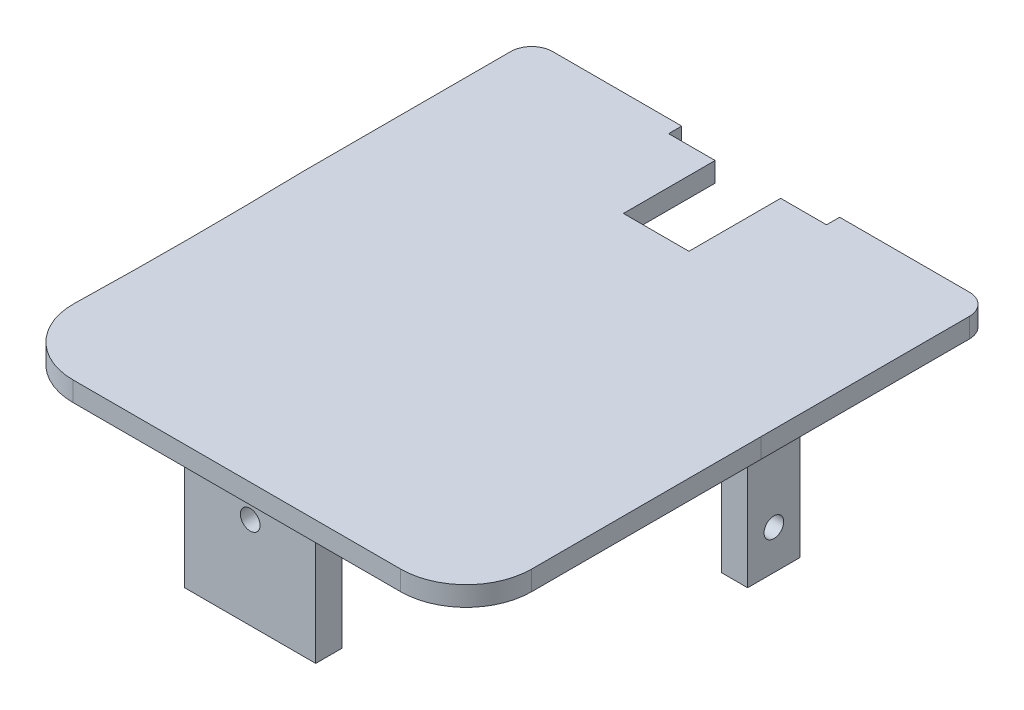
ISO-10303-21;
HEADER;
FILE_DESCRIPTION(('STEP AP214'),'2;1');
FILE_NAME('part.step','',(''),(''),'','','');
FILE_SCHEMA(('AUTOMOTIVE_DESIGN { 1 0 10303 214 1 1 1 1 }'));
ENDSEC;
DATA;
#1=APPLICATION_CONTEXT('core data for automotive mechanical design processes');
#2=APPLICATION_PROTOCOL_DEFINITION('international standard','automotive_design',2000,#1);
#3=PRODUCT_CONTEXT('',#1,'mechanical');
#4=PRODUCT('Part','Part','',(#3));
#5=PRODUCT_RELATED_PRODUCT_CATEGORY('part','',(#4));
#6=PRODUCT_DEFINITION_FORMATION('','',#4);
#7=PRODUCT_DEFINITION_CONTEXT('part definition',#1,'design');
#8=PRODUCT_DEFINITION('design','',#6,#7);
#9=PRODUCT_DEFINITION_SHAPE('','',#8);
#10=(LENGTH_UNIT() NAMED_UNIT(*) SI_UNIT(.MILLI.,.METRE.));
#11=(NAMED_UNIT(*) PLANE_ANGLE_UNIT() SI_UNIT($,.RADIAN.));
#12=(NAMED_UNIT(*) SI_UNIT($,.STERADIAN.) SOLID_ANGLE_UNIT());
#13=UNCERTAINTY_MEASURE_WITH_UNIT(LENGTH_MEASURE(1.E-05),#10,'distance_accuracy_value','');
#14=(GEOMETRIC_REPRESENTATION_CONTEXT(3) GLOBAL_UNCERTAINTY_ASSIGNED_CONTEXT((#13)) GLOBAL_UNIT_ASSIGNED_CONTEXT((#10,
#11,#12)) REPRESENTATION_CONTEXT('',''));
#15=CARTESIAN_POINT('',(0.,0.,0.));
#16=DIRECTION('',(0.,0.,1.));
#17=DIRECTION('',(1.,0.,0.));
#18=AXIS2_PLACEMENT_3D('',#15,#16,#17);
#19=CARTESIAN_POINT('',(0.,-19.,0.));
#20=DIRECTION('',(0.,1.,0.));
#21=DIRECTION('',(0.,0.,1.));
#22=AXIS2_PLACEMENT_3D('',#19,#20,#21);
#23=PLANE('',#22);
#24=DIRECTION('',(-1.,0.,0.));
#25=VECTOR('',#24,1.);
#26=CARTESIAN_POINT('',(-7.23999999999991,-19.,-1.24999999999999));
#27=LINE('',#26,#25);
#28=CARTESIAN_POINT('',(-7.23999999999991,-19.,-1.24999999999999));
#29=VERTEX_POINT('',#28);
#30=CARTESIAN_POINT('',(-8.23999999999991,-19.,-1.24999999999999));
#31=VERTEX_POINT('',#30);
#32=EDGE_CURVE('E431',#29,#31,#27,.T.);
#33=ORIENTED_EDGE('',*,*,#32,.F.);
#34=DIRECTION('',(0.,0.,-1.));
#35=VECTOR('',#34,1.);
#36=CARTESIAN_POINT('',(-7.23999999999991,-19.,-1.24999999999999));
#37=LINE('',#36,#35);
#38=CARTESIAN_POINT('',(-7.23999999999991,-19.,-3.24999999999999));
#39=VERTEX_POINT('',#38);
#40=EDGE_CURVE('E418',#29,#39,#37,.T.);
#41=ORIENTED_EDGE('',*,*,#40,.T.);
#42=DIRECTION('',(-1.,0.,0.));
#43=VECTOR('',#42,1.);
#44=CARTESIAN_POINT('',(-7.23999999999991,-19.,-3.24999999999999));
#45=LINE('',#44,#43);
#46=CARTESIAN_POINT('',(-8.23999999999991,-19.,-3.24999999999999));
#47=VERTEX_POINT('',#46);
#48=EDGE_CURVE('E422',#39,#47,#45,.T.);
#49=ORIENTED_EDGE('',*,*,#48,.T.);
#50=DIRECTION('',(0.,0.,-1.));
#51=VECTOR('',#50,1.);
#52=CARTESIAN_POINT('',(-8.23999999999991,-19.,-1.24999999999999));
#53=LINE('',#52,#51);
#54=EDGE_CURVE('E427',#31,#47,#53,.T.);
#55=ORIENTED_EDGE('',*,*,#54,.F.);
#56=EDGE_LOOP('',(#33,#41,#49,#55));
#57=FACE_BOUND('',#56,.T.);
#58=DIRECTION('',(0.,0.,-1.));
#59=VECTOR('',#58,1.);
#60=CARTESIAN_POINT('',(-2.49999999999991,-19.,0.));
#61=LINE('',#60,#59);
#62=CARTESIAN_POINT('',(-2.49999999999991,-19.,9.49));
#63=VERTEX_POINT('',#62);
#64=CARTESIAN_POINT('',(-2.49999999999991,-19.,8.49000000000001));
#65=VERTEX_POINT('',#64);
#66=EDGE_CURVE('E566',#63,#65,#61,.T.);
#67=ORIENTED_EDGE('',*,*,#66,.F.);
#68=DIRECTION('',(1.,0.,0.));
#69=VECTOR('',#68,1.);
#70=CARTESIAN_POINT('',(0.,-19.,9.49));
#71=LINE('',#70,#69);
#72=CARTESIAN_POINT('',(2.50000000000009,-19.,9.49000000000001));
#73=VERTEX_POINT('',#72);
#74=EDGE_CURVE('E533',#63,#73,#71,.T.);
#75=ORIENTED_EDGE('',*,*,#74,.T.);
#76=DIRECTION('',(0.,0.,-1.));
#77=VECTOR('',#76,1.);
#78=CARTESIAN_POINT('',(2.50000000000009,-19.,0.));
#79=LINE('',#78,#77);
#80=CARTESIAN_POINT('',(2.50000000000009,-19.,8.49000000000001));
#81=VERTEX_POINT('',#80);
#82=EDGE_CURVE('E580',#73,#81,#79,.T.);
#83=ORIENTED_EDGE('',*,*,#82,.T.);
#84=DIRECTION('',(1.,0.,0.));
#85=VECTOR('',#84,1.);
#86=CARTESIAN_POINT('',(0.,-19.,8.49000000000001));
#87=LINE('',#86,#85);
#88=EDGE_CURVE('E584',#65,#81,#87,.T.);
#89=ORIENTED_EDGE('',*,*,#88,.F.);
#90=EDGE_LOOP('',(#67,#75,#83,#89));
#91=FACE_BOUND('',#90,.T.);
#92=DIRECTION('',(0.,0.,-1.));
#93=VECTOR('',#92,1.);
#94=CARTESIAN_POINT('',(7.23999999999991,-19.,-1.24999999999999));
#95=LINE('',#94,#93);
#96=CARTESIAN_POINT('',(7.23999999999991,-19.,-1.24999999999999));
#97=VERTEX_POINT('',#96);
#98=CARTESIAN_POINT('',(7.23999999999991,-19.,-3.24999999999999));
#99=VERTEX_POINT('',#98);
#100=EDGE_CURVE('E374',#97,#99,#95,.T.);
#101=ORIENTED_EDGE('',*,*,#100,.F.);
#102=DIRECTION('',(1.,0.,0.));
#103=VECTOR('',#102,1.);
#104=CARTESIAN_POINT('',(7.23999999999991,-19.,-1.24999999999999));
#105=LINE('',#104,#103);
#106=CARTESIAN_POINT('',(8.23999999999991,-19.,-1.24999999999999));
#107=VERTEX_POINT('',#106);
#108=EDGE_CURVE('E354',#97,#107,#105,.T.);
#109=ORIENTED_EDGE('',*,*,#108,.T.);
#110=DIRECTION('',(0.,0.,-1.));
#111=VECTOR('',#110,1.);
#112=CARTESIAN_POINT('',(8.23999999999991,-19.,-1.24999999999999));
#113=LINE('',#112,#111);
#114=CARTESIAN_POINT('',(8.23999999999991,-19.,-3.24999999999999));
#115=VERTEX_POINT('',#114);
#116=EDGE_CURVE('E360',#107,#115,#113,.T.);
#117=ORIENTED_EDGE('',*,*,#116,.T.);
#118=DIRECTION('',(1.,0.,0.));
#119=VECTOR('',#118,1.);
#120=CARTESIAN_POINT('',(7.23999999999991,-19.,-3.24999999999999));
#121=LINE('',#120,#119);
#122=EDGE_CURVE('E377',#99,#115,#121,.T.);
#123=ORIENTED_EDGE('',*,*,#122,.F.);
#124=EDGE_LOOP('',(#101,#109,#117,#123));
#125=FACE_BOUND('',#124,.T.);
#126=DIRECTION('',(1.,0.,0.));
#127=VECTOR('',#126,1.);
#128=CARTESIAN_POINT('',(0.,-19.,-9.5));
#129=LINE('',#128,#127);
#130=CARTESIAN_POINT('',(1.25,-19.,-9.5));
#131=VERTEX_POINT('',#130);
#132=CARTESIAN_POINT('',(3.0000000000001,-19.,-9.5));
#133=VERTEX_POINT('',#132);
#134=EDGE_CURVE('E302',#131,#133,#129,.T.);
#135=ORIENTED_EDGE('',*,*,#134,.T.);
#136=DIRECTION('',(0.,0.,-1.));
#137=VECTOR('',#136,1.);
#138=CARTESIAN_POINT('',(3.0000000000001,-19.,0.));
#139=LINE('',#138,#137);
#140=CARTESIAN_POINT('',(3.0000000000001,-19.,-10.));
#141=VERTEX_POINT('',#140);
#142=EDGE_CURVE('E310',#133,#141,#139,.T.);
#143=ORIENTED_EDGE('',*,*,#142,.T.);
#144=DIRECTION('',(1.,0.,0.));
#145=VECTOR('',#144,1.);
#146=CARTESIAN_POINT('',(6.25035369334842,-19.,-10.));
#147=LINE('',#146,#145);
#148=CARTESIAN_POINT('',(7.95,-19.,-10.));
#149=VERTEX_POINT('',#148);
#150=EDGE_CURVE('E514',#141,#149,#147,.T.);
#151=ORIENTED_EDGE('',*,*,#150,.T.);
#152=CARTESIAN_POINT('',(7.95,-19.,-9.2));
#153=DIRECTION('',(0.,-1.,0.));
#154=DIRECTION('',(-1.,0.,0.));
#155=AXIS2_PLACEMENT_3D('',#152,#153,#154);
#156=CIRCLE('',#155,0.799999999999999);
#157=CARTESIAN_POINT('',(8.75,-19.,-9.2));
#158=VERTEX_POINT('',#157);
#159=EDGE_CURVE('E519',#149,#158,#156,.T.);
#160=ORIENTED_EDGE('',*,*,#159,.T.);
#161=DIRECTION('',(0.,0.,1.));
#162=VECTOR('',#161,1.);
#163=CARTESIAN_POINT('',(8.75000000000019,-19.,7.49999999999998));
#164=LINE('',#163,#162);
#165=CARTESIAN_POINT('',(8.75000000000009,-19.,-1.24985685423402));
#166=VERTEX_POINT('',#165);
#167=EDGE_CURVE('E523',#158,#166,#164,.T.);
#168=ORIENTED_EDGE('',*,*,#167,.T.);
#169=CARTESIAN_POINT('',(7146.43659782316,-19.,2.83611137688888));
#170=DIRECTION('',(0.,-1.,0.));
#171=DIRECTION('',(-1.,0.,0.));
#172=AXIS2_PLACEMENT_3D('',#169,#170,#171);
#173=CIRCLE('',#172,7137.68776732919);
#174=CARTESIAN_POINT('',(8.75035316004968,-19.,7.49836702872153));
#175=VERTEX_POINT('',#174);
#176=EDGE_CURVE('E454',#175,#166,#173,.T.);
#177=ORIENTED_EDGE('',*,*,#176,.F.);
#178=CARTESIAN_POINT('',(6.25035369334842,-19.,7.50000000000001));
#179=DIRECTION('',(0.,-1.,0.));
#180=DIRECTION('',(-1.,0.,0.));
#181=AXIS2_PLACEMENT_3D('',#178,#179,#180);
#182=CIRCLE('',#181,2.50000000001985);
#183=CARTESIAN_POINT('',(6.25035369334842,-19.,10.0000000000199));
#184=VERTEX_POINT('',#183);
#185=EDGE_CURVE('E435',#175,#184,#182,.T.);
#186=ORIENTED_EDGE('',*,*,#185,.T.);
#187=DIRECTION('',(-1.,0.,0.));
#188=VECTOR('',#187,1.);
#189=CARTESIAN_POINT('',(6.25035369334842,-19.,10.));
#190=LINE('',#189,#188);
#191=CARTESIAN_POINT('',(-6.25035369334842,-19.,10.));
#192=VERTEX_POINT('',#191);
#193=EDGE_CURVE('E494',#184,#192,#190,.T.);
#194=ORIENTED_EDGE('',*,*,#193,.T.);
#195=CARTESIAN_POINT('',(-6.25035369334842,-19.,7.50000000000001));
#196=DIRECTION('',(0.,-1.,0.));
#197=DIRECTION('',(-1.,0.,0.));
#198=AXIS2_PLACEMENT_3D('',#195,#196,#197);
#199=CIRCLE('',#198,2.5);
#200=CARTESIAN_POINT('',(-8.74988909304815,-19.,7.4518047134259));
#201=VERTEX_POINT('',#200);
#202=EDGE_CURVE('E498',#192,#201,#199,.T.);
#203=ORIENTED_EDGE('',*,*,#202,.T.);
#204=CARTESIAN_POINT('',(-195.35540780817,-19.,3.10619409471218));
#205=DIRECTION('',(0.,-1.,0.));
#206=DIRECTION('',(-1.,0.,0.));
#207=AXIS2_PLACEMENT_3D('',#204,#205,#206);
#208=CIRCLE('',#207,186.656111463272);
#209=CARTESIAN_POINT('',(-8.74999999999991,-19.,-1.24417638786854));
#210=VERTEX_POINT('',#209);
#211=EDGE_CURVE('E502',#201,#210,#208,.F.);
#212=ORIENTED_EDGE('',*,*,#211,.T.);
#213=DIRECTION('',(0.,0.,-1.));
#214=VECTOR('',#213,1.);
#215=CARTESIAN_POINT('',(-8.74999999999981,-19.,7.50000000000018));
#216=LINE('',#215,#214);
#217=CARTESIAN_POINT('',(-8.75,-19.,-9.19999999999999));
#218=VERTEX_POINT('',#217);
#219=EDGE_CURVE('E506',#210,#218,#216,.T.);
#220=ORIENTED_EDGE('',*,*,#219,.T.);
#221=CARTESIAN_POINT('',(-7.95,-19.,-9.2));
#222=DIRECTION('',(0.,-1.,0.));
#223=DIRECTION('',(-1.,0.,0.));
#224=AXIS2_PLACEMENT_3D('',#221,#222,#223);
#225=CIRCLE('',#224,0.799999999999999);
#226=CARTESIAN_POINT('',(-7.95,-19.,-10.));
#227=VERTEX_POINT('',#226);
#228=EDGE_CURVE('E510',#218,#227,#225,.T.);
#229=ORIENTED_EDGE('',*,*,#228,.T.);
#230=CARTESIAN_POINT('',(-3.02502602503907,-19.,-9.99999999999999));
#231=VERTEX_POINT('',#230);
#232=EDGE_CURVE('E515',#227,#231,#147,.T.);
#233=ORIENTED_EDGE('',*,*,#232,.T.);
#234=DIRECTION('',(0.,0.,-1.));
#235=VECTOR('',#234,1.);
#236=CARTESIAN_POINT('',(-3.02502602503907,-19.,0.));
#237=LINE('',#236,#235);
#238=CARTESIAN_POINT('',(-3.02502602503907,-19.,-9.5));
#239=VERTEX_POINT('',#238);
#240=EDGE_CURVE('E125',#239,#231,#237,.T.);
#241=ORIENTED_EDGE('',*,*,#240,.F.);
#242=CARTESIAN_POINT('',(-1.25,-19.,-9.5));
#243=VERTEX_POINT('',#242);
#244=EDGE_CURVE('E316',#239,#243,#129,.T.);
#245=ORIENTED_EDGE('',*,*,#244,.T.);
#246=DIRECTION('',(0.,0.,-1.));
#247=VECTOR('',#246,1.);
#248=CARTESIAN_POINT('',(-1.25,-19.,0.));
#249=LINE('',#248,#247);
#250=CARTESIAN_POINT('',(-1.25,-19.,-6.));
#251=VERTEX_POINT('',#250);
#252=EDGE_CURVE('E607',#251,#243,#249,.T.);
#253=ORIENTED_EDGE('',*,*,#252,.F.);
#254=DIRECTION('',(1.,0.,0.));
#255=VECTOR('',#254,1.);
#256=CARTESIAN_POINT('',(0.,-19.,-6.));
#257=LINE('',#256,#255);
#258=CARTESIAN_POINT('',(1.25,-19.,-6.));
#259=VERTEX_POINT('',#258);
#260=EDGE_CURVE('E618',#251,#259,#257,.T.);
#261=ORIENTED_EDGE('',*,*,#260,.T.);
#262=DIRECTION('',(0.,0.,-1.));
#263=VECTOR('',#262,1.);
#264=CARTESIAN_POINT('',(1.25,-19.,0.));
#265=LINE('',#264,#263);
#266=EDGE_CURVE('E321',#259,#131,#265,.T.);
#267=ORIENTED_EDGE('',*,*,#266,.T.);
#268=EDGE_LOOP('',(#135,#143,#151,#160,#168,#177,#186,#194,#203,#212,#220,#229,#233,#241,#245,
#253,#261,#267));
#269=FACE_BOUND('',#268,.T.);
#270=ADVANCED_FACE('F101',(#57,#91,#125,#269),#23,.F.);
#271=CARTESIAN_POINT('',(0.,-18.25,0.));
#272=DIRECTION('',(0.,1.,0.));
#273=DIRECTION('',(0.,0.,1.));
#274=AXIS2_PLACEMENT_3D('',#271,#272,#273);
#275=PLANE('',#274);
#276=DIRECTION('',(0.,0.,-1.));
#277=VECTOR('',#276,1.);
#278=CARTESIAN_POINT('',(3.0000000000001,-18.25,0.));
#279=LINE('',#278,#277);
#280=CARTESIAN_POINT('',(3.0000000000001,-18.25,-9.5));
#281=VERTEX_POINT('',#280);
#282=CARTESIAN_POINT('',(3.0000000000001,-18.25,-10.));
#283=VERTEX_POINT('',#282);
#284=EDGE_CURVE('E117',#281,#283,#279,.T.);
#285=ORIENTED_EDGE('',*,*,#284,.F.);
#286=DIRECTION('',(1.,0.,0.));
#287=VECTOR('',#286,1.);
#288=CARTESIAN_POINT('',(0.,-18.25,-9.5));
#289=LINE('',#288,#287);
#290=CARTESIAN_POINT('',(1.25,-18.25,-9.5));
#291=VERTEX_POINT('',#290);
#292=EDGE_CURVE('E304',#291,#281,#289,.T.);
#293=ORIENTED_EDGE('',*,*,#292,.F.);
#294=DIRECTION('',(0.,0.,-1.));
#295=VECTOR('',#294,1.);
#296=CARTESIAN_POINT('',(1.25,-18.25,0.));
#297=LINE('',#296,#295);
#298=CARTESIAN_POINT('',(1.25,-18.25,-6.));
#299=VERTEX_POINT('',#298);
#300=EDGE_CURVE('E602',#299,#291,#297,.T.);
#301=ORIENTED_EDGE('',*,*,#300,.F.);
#302=DIRECTION('',(1.,0.,0.));
#303=VECTOR('',#302,1.);
#304=CARTESIAN_POINT('',(0.,-18.25,-6.));
#305=LINE('',#304,#303);
#306=CARTESIAN_POINT('',(-1.25,-18.25,-6.));
#307=VERTEX_POINT('',#306);
#308=EDGE_CURVE('E606',#307,#299,#305,.T.);
#309=ORIENTED_EDGE('',*,*,#308,.F.);
#310=DIRECTION('',(0.,0.,-1.));
#311=VECTOR('',#310,1.);
#312=CARTESIAN_POINT('',(-1.25,-18.25,0.));
#313=LINE('',#312,#311);
#314=CARTESIAN_POINT('',(-1.25,-18.25,-9.5));
#315=VERTEX_POINT('',#314);
#316=EDGE_CURVE('E611',#307,#315,#313,.T.);
#317=ORIENTED_EDGE('',*,*,#316,.T.);
#318=CARTESIAN_POINT('',(-3.02502602503907,-18.25,-9.5));
#319=VERTEX_POINT('',#318);
#320=EDGE_CURVE('E328',#319,#315,#289,.T.);
#321=ORIENTED_EDGE('',*,*,#320,.F.);
#322=DIRECTION('',(0.,0.,-1.));
#323=VECTOR('',#322,1.);
#324=CARTESIAN_POINT('',(-3.02502602503907,-18.25,0.));
#325=LINE('',#324,#323);
#326=CARTESIAN_POINT('',(-3.02502602503907,-18.25,-9.99999999999999));
#327=VERTEX_POINT('',#326);
#328=EDGE_CURVE('E306',#319,#327,#325,.T.);
#329=ORIENTED_EDGE('',*,*,#328,.T.);
#330=DIRECTION('',(1.,0.,0.));
#331=VECTOR('',#330,1.);
#332=CARTESIAN_POINT('',(6.25035369334842,-18.25,-10.));
#333=LINE('',#332,#331);
#334=CARTESIAN_POINT('',(-7.95,-18.25,-10.));
#335=VERTEX_POINT('',#334);
#336=EDGE_CURVE('E475',#335,#327,#333,.T.);
#337=ORIENTED_EDGE('',*,*,#336,.F.);
#338=CARTESIAN_POINT('',(-7.95,-18.25,-9.2));
#339=DIRECTION('',(0.,-1.,0.));
#340=DIRECTION('',(-1.,0.,0.));
#341=AXIS2_PLACEMENT_3D('',#338,#339,#340);
#342=CIRCLE('',#341,0.799999999999999);
#343=CARTESIAN_POINT('',(-8.75,-18.25,-9.19999999999999));
#344=VERTEX_POINT('',#343);
#345=EDGE_CURVE('E470',#344,#335,#342,.T.);
#346=ORIENTED_EDGE('',*,*,#345,.F.);
#347=DIRECTION('',(0.,0.,-1.));
#348=VECTOR('',#347,1.);
#349=CARTESIAN_POINT('',(-8.74999999999981,-18.25,7.50000000000018));
#350=LINE('',#349,#348);
#351=CARTESIAN_POINT('',(-8.74999999999991,-18.25,-1.24417638786854));
#352=VERTEX_POINT('',#351);
#353=EDGE_CURVE('E466',#352,#344,#350,.T.);
#354=ORIENTED_EDGE('',*,*,#353,.F.);
#355=CARTESIAN_POINT('',(-195.35540780817,-18.25,3.10619409471218));
#356=DIRECTION('',(0.,-1.,0.));
#357=DIRECTION('',(-1.,0.,0.));
#358=AXIS2_PLACEMENT_3D('',#355,#356,#357);
#359=CIRCLE('',#358,186.656111463272);
#360=CARTESIAN_POINT('',(-8.74988909304815,-18.25,7.4518047134259));
#361=VERTEX_POINT('',#360);
#362=EDGE_CURVE('E462',#361,#352,#359,.F.);
#363=ORIENTED_EDGE('',*,*,#362,.F.);
#364=CARTESIAN_POINT('',(-6.25035369334842,-18.25,7.50000000000001));
#365=DIRECTION('',(0.,-1.,0.));
#366=DIRECTION('',(-1.,0.,0.));
#367=AXIS2_PLACEMENT_3D('',#364,#365,#366);
#368=CIRCLE('',#367,2.5);
#369=CARTESIAN_POINT('',(-6.25035369334842,-18.25,10.));
#370=VERTEX_POINT('',#369);
#371=EDGE_CURVE('E458',#370,#361,#368,.T.);
#372=ORIENTED_EDGE('',*,*,#371,.F.);
#373=DIRECTION('',(-1.,0.,0.));
#374=VECTOR('',#373,1.);
#375=CARTESIAN_POINT('',(6.25035369334842,-18.25,10.));
#376=LINE('',#375,#374);
#377=CARTESIAN_POINT('',(6.25035369334842,-18.25,10.0000000000199));
#378=VERTEX_POINT('',#377);
#379=EDGE_CURVE('E453',#378,#370,#376,.T.);
#380=ORIENTED_EDGE('',*,*,#379,.F.);
#381=CARTESIAN_POINT('',(6.25035369334842,-18.25,7.50000000000001));
#382=DIRECTION('',(0.,-1.,0.));
#383=DIRECTION('',(-1.,0.,0.));
#384=AXIS2_PLACEMENT_3D('',#381,#382,#383);
#385=CIRCLE('',#384,2.50000000001985);
#386=CARTESIAN_POINT('',(8.75035316004968,-18.25,7.49836702872153));
#387=VERTEX_POINT('',#386);
#388=EDGE_CURVE('E449',#387,#378,#385,.T.);
#389=ORIENTED_EDGE('',*,*,#388,.F.);
#390=CARTESIAN_POINT('',(7146.43659782316,-18.25,2.83611137688888));
#391=DIRECTION('',(0.,-1.,0.));
#392=DIRECTION('',(-1.,0.,0.));
#393=AXIS2_PLACEMENT_3D('',#390,#391,#392);
#394=CIRCLE('',#393,7137.68776732919);
#395=CARTESIAN_POINT('',(8.75000000000009,-18.25,-1.24985685423402));
#396=VERTEX_POINT('',#395);
#397=EDGE_CURVE('E487',#387,#396,#394,.T.);
#398=ORIENTED_EDGE('',*,*,#397,.T.);
#399=DIRECTION('',(0.,0.,1.));
#400=VECTOR('',#399,1.);
#401=CARTESIAN_POINT('',(8.75000000000019,-18.25,7.49999999999998));
#402=LINE('',#401,#400);
#403=CARTESIAN_POINT('',(8.75,-18.25,-9.2));
#404=VERTEX_POINT('',#403);
#405=EDGE_CURVE('E483',#404,#396,#402,.T.);
#406=ORIENTED_EDGE('',*,*,#405,.F.);
#407=CARTESIAN_POINT('',(7.95,-18.25,-9.2));
#408=DIRECTION('',(0.,-1.,0.));
#409=DIRECTION('',(-1.,0.,0.));
#410=AXIS2_PLACEMENT_3D('',#407,#408,#409);
#411=CIRCLE('',#410,0.799999999999999);
#412=CARTESIAN_POINT('',(7.95,-18.25,-10.));
#413=VERTEX_POINT('',#412);
#414=EDGE_CURVE('E479',#413,#404,#411,.T.);
#415=ORIENTED_EDGE('',*,*,#414,.F.);
#416=EDGE_CURVE('E474',#283,#413,#333,.T.);
#417=ORIENTED_EDGE('',*,*,#416,.F.);
#418=EDGE_LOOP('',(#285,#293,#301,#309,#317,#321,#329,#337,#346,#354,#363,#372,#380,#389,#398,
#406,#415,#417));
#419=FACE_BOUND('',#418,.T.);
#420=ADVANCED_FACE('F643',(#419),#275,.T.);
#421=CARTESIAN_POINT('',(6.25035369334842,-18.25,-10.));
#422=DIRECTION('',(0.,0.,-1.));
#423=DIRECTION('',(-1.,0.,0.));
#424=AXIS2_PLACEMENT_3D('',#421,#422,#423);
#425=PLANE('',#424);
#426=ORIENTED_EDGE('',*,*,#150,.F.);
#427=DIRECTION('',(0.,-1.,0.));
#428=VECTOR('',#427,1.);
#429=CARTESIAN_POINT('',(3.0000000000001,-18.249,-10.));
#430=LINE('',#429,#428);
#431=EDGE_CURVE('E312',#283,#141,#430,.T.);
#432=ORIENTED_EDGE('',*,*,#431,.F.);
#433=ORIENTED_EDGE('',*,*,#416,.T.);
#434=DIRECTION('',(0.,-1.,0.));
#435=VECTOR('',#434,1.);
#436=CARTESIAN_POINT('',(7.95,-18.25,-10.));
#437=LINE('',#436,#435);
#438=EDGE_CURVE('E540',#413,#149,#437,.T.);
#439=ORIENTED_EDGE('',*,*,#438,.T.);
#440=EDGE_LOOP('',(#426,#432,#433,#439));
#441=FACE_BOUND('',#440,.T.);
#442=ADVANCED_FACE('F683',(#441),#425,.T.);
#443=CARTESIAN_POINT('',(1.25,-18.25,0.));
#444=DIRECTION('',(-1.,0.,0.));
#445=DIRECTION('',(0.,0.,1.));
#446=AXIS2_PLACEMENT_3D('',#443,#444,#445);
#447=PLANE('',#446);
#448=ORIENTED_EDGE('',*,*,#266,.F.);
#449=DIRECTION('',(0.,-1.,0.));
#450=VECTOR('',#449,1.);
#451=CARTESIAN_POINT('',(1.25,-18.25,-6.));
#452=LINE('',#451,#450);
#453=EDGE_CURVE('E110',#299,#259,#452,.T.);
#454=ORIENTED_EDGE('',*,*,#453,.F.);
#455=ORIENTED_EDGE('',*,*,#300,.T.);
#456=DIRECTION('',(0.,-1.,0.));
#457=VECTOR('',#456,1.);
#458=CARTESIAN_POINT('',(1.25,-18.25,-9.5));
#459=LINE('',#458,#457);
#460=EDGE_CURVE('E12',#291,#131,#459,.T.);
#461=ORIENTED_EDGE('',*,*,#460,.T.);
#462=EDGE_LOOP('',(#448,#454,#455,#461));
#463=FACE_BOUND('',#462,.T.);
#464=ADVANCED_FACE('F103',(#463),#447,.T.);
#465=CARTESIAN_POINT('',(0.,-18.25,-6.));
#466=DIRECTION('',(0.,0.,-1.));
#467=DIRECTION('',(-1.,0.,0.));
#468=AXIS2_PLACEMENT_3D('',#465,#466,#467);
#469=PLANE('',#468);
#470=ORIENTED_EDGE('',*,*,#260,.F.);
#471=DIRECTION('',(0.,-1.,0.));
#472=VECTOR('',#471,1.);
#473=CARTESIAN_POINT('',(-1.25,-18.25,-6.));
#474=LINE('',#473,#472);
#475=EDGE_CURVE('E626',#307,#251,#474,.T.);
#476=ORIENTED_EDGE('',*,*,#475,.F.);
#477=ORIENTED_EDGE('',*,*,#308,.T.);
#478=ORIENTED_EDGE('',*,*,#453,.T.);
#479=EDGE_LOOP('',(#470,#476,#477,#478));
#480=FACE_BOUND('',#479,.T.);
#481=ADVANCED_FACE('F631',(#480),#469,.T.);
#482=CARTESIAN_POINT('',(-1.25,-18.25,0.));
#483=DIRECTION('',(-1.,0.,0.));
#484=DIRECTION('',(0.,0.,1.));
#485=AXIS2_PLACEMENT_3D('',#482,#483,#484);
#486=PLANE('',#485);
#487=ORIENTED_EDGE('',*,*,#252,.T.);
#488=DIRECTION('',(0.,-1.,0.));
#489=VECTOR('',#488,1.);
#490=CARTESIAN_POINT('',(-1.25,-18.25,-9.5));
#491=LINE('',#490,#489);
#492=EDGE_CURVE('E615',#315,#243,#491,.T.);
#493=ORIENTED_EDGE('',*,*,#492,.F.);
#494=ORIENTED_EDGE('',*,*,#316,.F.);
#495=ORIENTED_EDGE('',*,*,#475,.T.);
#496=EDGE_LOOP('',(#487,#493,#494,#495));
#497=FACE_BOUND('',#496,.T.);
#498=ADVANCED_FACE('F639',(#497),#486,.F.);
#499=CARTESIAN_POINT('',(0.,-23.5,9.49));
#500=DIRECTION('',(0.,0.,1.));
#501=DIRECTION('',(1.,0.,0.));
#502=AXIS2_PLACEMENT_3D('',#499,#500,#501);
#503=PLANE('',#502);
#504=CARTESIAN_POINT('',(0.,-20.,9.49000000000001));
#505=DIRECTION('',(0.,0.,1.));
#506=DIRECTION('',(1.,0.,0.));
#507=AXIS2_PLACEMENT_3D('',#504,#505,#506);
#508=CIRCLE('',#507,0.374999999999988);
#509=CARTESIAN_POINT('',(0.374999999999986,-20.,9.49000000000001));
#510=VERTEX_POINT('',#509);
#511=EDGE_CURVE('E338',#510,#510,#508,.T.);
#512=ORIENTED_EDGE('',*,*,#511,.F.);
#513=EDGE_LOOP('',(#512));
#514=FACE_BOUND('',#513,.T.);
#515=ORIENTED_EDGE('',*,*,#74,.F.);
#516=DIRECTION('',(0.,1.,0.));
#517=VECTOR('',#516,1.);
#518=CARTESIAN_POINT('',(-2.49999999999991,-23.5,9.49));
#519=LINE('',#518,#517);
#520=CARTESIAN_POINT('',(-2.49999999999991,-23.5,9.49));
#521=VERTEX_POINT('',#520);
#522=EDGE_CURVE('E589',#521,#63,#519,.T.);
#523=ORIENTED_EDGE('',*,*,#522,.F.);
#524=DIRECTION('',(1.,0.,0.));
#525=VECTOR('',#524,1.);
#526=CARTESIAN_POINT('',(0.,-23.5,9.49));
#527=LINE('',#526,#525);
#528=CARTESIAN_POINT('',(2.50000000000009,-23.5,9.49000000000001));
#529=VERTEX_POINT('',#528);
#530=EDGE_CURVE('E561',#521,#529,#527,.T.);
#531=ORIENTED_EDGE('',*,*,#530,.T.);
#532=DIRECTION('',(0.,1.,0.));
#533=VECTOR('',#532,1.);
#534=CARTESIAN_POINT('',(2.50000000000009,-23.5,9.49000000000001));
#535=LINE('',#534,#533);
#536=EDGE_CURVE('E576',#529,#73,#535,.T.);
#537=ORIENTED_EDGE('',*,*,#536,.T.);
#538=EDGE_LOOP('',(#515,#523,#531,#537));
#539=FACE_BOUND('',#538,.T.);
#540=ADVANCED_FACE('F690',(#514,#539),#503,.T.);
#541=CARTESIAN_POINT('',(-2.49999999999991,-23.5,0.));
#542=DIRECTION('',(1.,0.,0.));
#543=DIRECTION('',(0.,0.,-1.));
#544=AXIS2_PLACEMENT_3D('',#541,#542,#543);
#545=PLANE('',#544);
#546=ORIENTED_EDGE('',*,*,#66,.T.);
#547=DIRECTION('',(0.,1.,0.));
#548=VECTOR('',#547,1.);
#549=CARTESIAN_POINT('',(-2.49999999999991,-23.5,8.49000000000001));
#550=LINE('',#549,#548);
#551=CARTESIAN_POINT('',(-2.49999999999991,-23.5,8.49000000000001));
#552=VERTEX_POINT('',#551);
#553=EDGE_CURVE('E592',#552,#65,#550,.T.);
#554=ORIENTED_EDGE('',*,*,#553,.F.);
#555=DIRECTION('',(0.,0.,-1.));
#556=VECTOR('',#555,1.);
#557=CARTESIAN_POINT('',(-2.49999999999991,-23.5,0.));
#558=LINE('',#557,#556);
#559=EDGE_CURVE('E573',#521,#552,#558,.T.);
#560=ORIENTED_EDGE('',*,*,#559,.F.);
#561=ORIENTED_EDGE('',*,*,#522,.T.);
#562=EDGE_LOOP('',(#546,#554,#560,#561));
#563=FACE_BOUND('',#562,.T.);
#564=ADVANCED_FACE('F783',(#563),#545,.F.);
#565=CARTESIAN_POINT('',(0.,-23.5,8.49000000000001));
#566=DIRECTION('',(0.,0.,1.));
#567=DIRECTION('',(1.,0.,0.));
#568=AXIS2_PLACEMENT_3D('',#565,#566,#567);
#569=PLANE('',#568);
#570=CARTESIAN_POINT('',(0.,-20.,8.49000000000001));
#571=DIRECTION('',(0.,0.,1.));
#572=DIRECTION('',(1.,0.,0.));
#573=AXIS2_PLACEMENT_3D('',#570,#571,#572);
#574=CIRCLE('',#573,0.374999999999994);
#575=CARTESIAN_POINT('',(0.374999999999992,-20.,8.49000000000001));
#576=VERTEX_POINT('',#575);
#577=EDGE_CURVE('E342',#576,#576,#574,.T.);
#578=ORIENTED_EDGE('',*,*,#577,.T.);
#579=EDGE_LOOP('',(#578));
#580=FACE_BOUND('',#579,.T.);
#581=ORIENTED_EDGE('',*,*,#88,.T.);
#582=DIRECTION('',(0.,1.,0.));
#583=VECTOR('',#582,1.);
#584=CARTESIAN_POINT('',(2.50000000000009,-23.5,8.49000000000001));
#585=LINE('',#584,#583);
#586=CARTESIAN_POINT('',(2.50000000000009,-23.5,8.49000000000001));
#587=VERTEX_POINT('',#586);
#588=EDGE_CURVE('E596',#587,#81,#585,.T.);
#589=ORIENTED_EDGE('',*,*,#588,.F.);
#590=DIRECTION('',(1.,0.,0.));
#591=VECTOR('',#590,1.);
#592=CARTESIAN_POINT('',(0.,-23.5,8.49000000000001));
#593=LINE('',#592,#591);
#594=EDGE_CURVE('E570',#552,#587,#593,.T.);
#595=ORIENTED_EDGE('',*,*,#594,.F.);
#596=ORIENTED_EDGE('',*,*,#553,.T.);
#597=EDGE_LOOP('',(#581,#589,#595,#596));
#598=FACE_BOUND('',#597,.T.);
#599=ADVANCED_FACE('F794',(#580,#598),#569,.F.);
#600=CARTESIAN_POINT('',(2.50000000000009,-23.5,0.));
#601=DIRECTION('',(1.,0.,0.));
#602=DIRECTION('',(0.,0.,-1.));
#603=AXIS2_PLACEMENT_3D('',#600,#601,#602);
#604=PLANE('',#603);
#605=ORIENTED_EDGE('',*,*,#82,.F.);
#606=ORIENTED_EDGE('',*,*,#536,.F.);
#607=DIRECTION('',(0.,0.,-1.));
#608=VECTOR('',#607,1.);
#609=CARTESIAN_POINT('',(2.50000000000009,-23.5,0.));
#610=LINE('',#609,#608);
#611=EDGE_CURVE('E565',#529,#587,#610,.T.);
#612=ORIENTED_EDGE('',*,*,#611,.T.);
#613=ORIENTED_EDGE('',*,*,#588,.T.);
#614=EDGE_LOOP('',(#605,#606,#612,#613));
#615=FACE_BOUND('',#614,.T.);
#616=ADVANCED_FACE('F801',(#615),#604,.T.);
#617=CARTESIAN_POINT('',(0.,-23.5,0.));
#618=DIRECTION('',(0.,1.,0.));
#619=DIRECTION('',(0.,0.,1.));
#620=AXIS2_PLACEMENT_3D('',#617,#618,#619);
#621=PLANE('',#620);
#622=ORIENTED_EDGE('',*,*,#530,.F.);
#623=ORIENTED_EDGE('',*,*,#559,.T.);
#624=ORIENTED_EDGE('',*,*,#594,.T.);
#625=ORIENTED_EDGE('',*,*,#611,.F.);
#626=EDGE_LOOP('',(#622,#623,#624,#625));
#627=FACE_BOUND('',#626,.T.);
#628=ADVANCED_FACE('F799',(#627),#621,.F.);
#629=CARTESIAN_POINT('',(6.25035369334842,-18.25,7.50000000000001));
#630=DIRECTION('',(0.,-1.,0.));
#631=DIRECTION('',(0.,0.,-1.));
#632=AXIS2_PLACEMENT_3D('',#629,#630,#631);
#633=CYLINDRICAL_SURFACE('',#632,2.50000000001985);
#634=ORIENTED_EDGE('',*,*,#185,.F.);
#635=DIRECTION('',(0.,-1.,0.));
#636=VECTOR('',#635,1.);
#637=CARTESIAN_POINT('',(8.75035316004968,-18.25,7.49836702872153));
#638=LINE('',#637,#636);
#639=EDGE_CURVE('E530',#387,#175,#638,.T.);
#640=ORIENTED_EDGE('',*,*,#639,.F.);
#641=ORIENTED_EDGE('',*,*,#388,.T.);
#642=DIRECTION('',(0.,-1.,0.));
#643=VECTOR('',#642,1.);
#644=CARTESIAN_POINT('',(6.25035369334842,-18.25,10.0000000000199));
#645=LINE('',#644,#643);
#646=EDGE_CURVE('E490',#378,#184,#645,.T.);
#647=ORIENTED_EDGE('',*,*,#646,.T.);
#648=EDGE_LOOP('',(#634,#640,#641,#647));
#649=FACE_BOUND('',#648,.T.);
#650=ADVANCED_FACE('F723',(#649),#633,.T.);
#651=CARTESIAN_POINT('',(7146.43659782316,-18.25,2.83611137688888));
#652=DIRECTION('',(0.,-1.,0.));
#653=DIRECTION('',(0.,0.,-1.));
#654=AXIS2_PLACEMENT_3D('',#651,#652,#653);
#655=CYLINDRICAL_SURFACE('',#654,7137.68776732919);
#656=ORIENTED_EDGE('',*,*,#176,.T.);
#657=DIRECTION('',(0.,-1.,0.));
#658=VECTOR('',#657,1.);
#659=CARTESIAN_POINT('',(8.75000000000009,-18.25,-1.24985685423402));
#660=LINE('',#659,#658);
#661=EDGE_CURVE('E534',#396,#166,#660,.T.);
#662=ORIENTED_EDGE('',*,*,#661,.F.);
#663=ORIENTED_EDGE('',*,*,#397,.F.);
#664=ORIENTED_EDGE('',*,*,#639,.T.);
#665=EDGE_LOOP('',(#656,#662,#663,#664));
#666=FACE_BOUND('',#665,.T.);
#667=ADVANCED_FACE('F716',(#666),#655,.F.);
#668=CARTESIAN_POINT('',(8.75000000000019,-18.25,7.49999999999998));
#669=DIRECTION('',(1.,0.,0.));
#670=DIRECTION('',(0.,0.,-1.));
#671=AXIS2_PLACEMENT_3D('',#668,#669,#670);
#672=PLANE('',#671);
#673=ORIENTED_EDGE('',*,*,#167,.F.);
#674=DIRECTION('',(0.,-1.,0.));
#675=VECTOR('',#674,1.);
#676=CARTESIAN_POINT('',(8.75,-18.25,-9.2));
#677=LINE('',#676,#675);
#678=EDGE_CURVE('E537',#404,#158,#677,.T.);
#679=ORIENTED_EDGE('',*,*,#678,.F.);
#680=ORIENTED_EDGE('',*,*,#405,.T.);
#681=ORIENTED_EDGE('',*,*,#661,.T.);
#682=EDGE_LOOP('',(#673,#679,#680,#681));
#683=FACE_BOUND('',#682,.T.);
#684=ADVANCED_FACE('F711',(#683),#672,.T.);
#685=CARTESIAN_POINT('',(7.95,-18.25,-9.2));
#686=DIRECTION('',(0.,-1.,0.));
#687=DIRECTION('',(0.,0.,-1.));
#688=AXIS2_PLACEMENT_3D('',#685,#686,#687);
#689=CYLINDRICAL_SURFACE('',#688,0.799999999999999);
#690=ORIENTED_EDGE('',*,*,#159,.F.);
#691=ORIENTED_EDGE('',*,*,#438,.F.);
#692=ORIENTED_EDGE('',*,*,#414,.T.);
#693=ORIENTED_EDGE('',*,*,#678,.T.);
#694=EDGE_LOOP('',(#690,#691,#692,#693));
#695=FACE_BOUND('',#694,.T.);
#696=ADVANCED_FACE('F705',(#695),#689,.T.);
#697=DIRECTION('',(0.,-1.,0.));
#698=VECTOR('',#697,1.);
#699=CARTESIAN_POINT('',(-3.02502602503907,-18.249,-9.99999999999999));
#700=LINE('',#699,#698);
#701=EDGE_CURVE('E650',#327,#231,#700,.T.);
#702=ORIENTED_EDGE('',*,*,#701,.T.);
#703=ORIENTED_EDGE('',*,*,#232,.F.);
#704=DIRECTION('',(0.,-1.,0.));
#705=VECTOR('',#704,1.);
#706=CARTESIAN_POINT('',(-7.95,-18.25,-10.));
#707=LINE('',#706,#705);
#708=EDGE_CURVE('E544',#335,#227,#707,.T.);
#709=ORIENTED_EDGE('',*,*,#708,.F.);
#710=ORIENTED_EDGE('',*,*,#336,.T.);
#711=EDGE_LOOP('',(#702,#703,#709,#710));
#712=FACE_BOUND('',#711,.T.);
#713=ADVANCED_FACE('F656',(#712),#425,.T.);
#714=CARTESIAN_POINT('',(-7.95,-18.25,-9.2));
#715=DIRECTION('',(0.,-1.,0.));
#716=DIRECTION('',(0.,0.,-1.));
#717=AXIS2_PLACEMENT_3D('',#714,#715,#716);
#718=CYLINDRICAL_SURFACE('',#717,0.799999999999999);
#719=ORIENTED_EDGE('',*,*,#228,.F.);
#720=DIRECTION('',(0.,-1.,0.));
#721=VECTOR('',#720,1.);
#722=CARTESIAN_POINT('',(-8.75,-18.25,-9.19999999999999));
#723=LINE('',#722,#721);
#724=EDGE_CURVE('E547',#344,#218,#723,.T.);
#725=ORIENTED_EDGE('',*,*,#724,.F.);
#726=ORIENTED_EDGE('',*,*,#345,.T.);
#727=ORIENTED_EDGE('',*,*,#708,.T.);
#728=EDGE_LOOP('',(#719,#725,#726,#727));
#729=FACE_BOUND('',#728,.T.);
#730=ADVANCED_FACE('F662',(#729),#718,.T.);
#731=CARTESIAN_POINT('',(-8.74999999999981,-18.25,7.50000000000018));
#732=DIRECTION('',(-1.,0.,0.));
#733=DIRECTION('',(0.,0.,1.));
#734=AXIS2_PLACEMENT_3D('',#731,#732,#733);
#735=PLANE('',#734);
#736=ORIENTED_EDGE('',*,*,#219,.F.);
#737=DIRECTION('',(0.,-1.,0.));
#738=VECTOR('',#737,1.);
#739=CARTESIAN_POINT('',(-8.74999999999991,-18.25,-1.24417638786854));
#740=LINE('',#739,#738);
#741=EDGE_CURVE('E550',#352,#210,#740,.T.);
#742=ORIENTED_EDGE('',*,*,#741,.F.);
#743=ORIENTED_EDGE('',*,*,#353,.T.);
#744=ORIENTED_EDGE('',*,*,#724,.T.);
#745=EDGE_LOOP('',(#736,#742,#743,#744));
#746=FACE_BOUND('',#745,.T.);
#747=ADVANCED_FACE('F710',(#746),#735,.T.);
#748=CARTESIAN_POINT('',(-195.35540780817,-18.25,3.10619409471218));
#749=DIRECTION('',(0.,-1.,0.));
#750=DIRECTION('',(0.,0.,-1.));
#751=AXIS2_PLACEMENT_3D('',#748,#749,#750);
#752=CYLINDRICAL_SURFACE('',#751,186.656111463272);
#753=ORIENTED_EDGE('',*,*,#211,.F.);
#754=DIRECTION('',(0.,-1.,0.));
#755=VECTOR('',#754,1.);
#756=CARTESIAN_POINT('',(-8.74988909304815,-18.25,7.4518047134259));
#757=LINE('',#756,#755);
#758=EDGE_CURVE('E553',#361,#201,#757,.T.);
#759=ORIENTED_EDGE('',*,*,#758,.F.);
#760=ORIENTED_EDGE('',*,*,#362,.T.);
#761=ORIENTED_EDGE('',*,*,#741,.T.);
#762=EDGE_LOOP('',(#753,#759,#760,#761));
#763=FACE_BOUND('',#762,.T.);
#764=ADVANCED_FACE('F823',(#763),#752,.F.);
#765=CARTESIAN_POINT('',(-6.25035369334842,-18.25,7.50000000000001));
#766=DIRECTION('',(0.,-1.,0.));
#767=DIRECTION('',(0.,0.,-1.));
#768=AXIS2_PLACEMENT_3D('',#765,#766,#767);
#769=CYLINDRICAL_SURFACE('',#768,2.5);
#770=ORIENTED_EDGE('',*,*,#202,.F.);
#771=DIRECTION('',(0.,-1.,0.));
#772=VECTOR('',#771,1.);
#773=CARTESIAN_POINT('',(-6.25035369334842,-18.25,10.));
#774=LINE('',#773,#772);
#775=EDGE_CURVE('E556',#370,#192,#774,.T.);
#776=ORIENTED_EDGE('',*,*,#775,.F.);
#777=ORIENTED_EDGE('',*,*,#371,.T.);
#778=ORIENTED_EDGE('',*,*,#758,.T.);
#779=EDGE_LOOP('',(#770,#776,#777,#778));
#780=FACE_BOUND('',#779,.T.);
#781=ADVANCED_FACE('F819',(#780),#769,.T.);
#782=CARTESIAN_POINT('',(6.25035369334842,-18.25,10.));
#783=DIRECTION('',(0.,0.,1.));
#784=DIRECTION('',(1.,0.,0.));
#785=AXIS2_PLACEMENT_3D('',#782,#783,#784);
#786=PLANE('',#785);
#787=ORIENTED_EDGE('',*,*,#193,.F.);
#788=ORIENTED_EDGE('',*,*,#646,.F.);
#789=ORIENTED_EDGE('',*,*,#379,.T.);
#790=ORIENTED_EDGE('',*,*,#775,.T.);
#791=EDGE_LOOP('',(#787,#788,#789,#790));
#792=FACE_BOUND('',#791,.T.);
#793=ADVANCED_FACE('F745',(#792),#786,.T.);
#794=CARTESIAN_POINT('',(-7.23999999999991,-23.5,-1.24999999999999));
#795=DIRECTION('',(0.,0.,-1.));
#796=DIRECTION('',(-1.,0.,0.));
#797=AXIS2_PLACEMENT_3D('',#794,#795,#796);
#798=PLANE('',#797);
#799=ORIENTED_EDGE('',*,*,#32,.T.);
#800=DIRECTION('',(0.,1.,0.));
#801=VECTOR('',#800,1.);
#802=CARTESIAN_POINT('',(-8.23999999999991,-23.5,-1.24999999999999));
#803=LINE('',#802,#801);
#804=CARTESIAN_POINT('',(-8.23999999999991,-23.5,-1.24999999999999));
#805=VERTEX_POINT('',#804);
#806=EDGE_CURVE('E404',#805,#31,#803,.T.);
#807=ORIENTED_EDGE('',*,*,#806,.F.);
#808=DIRECTION('',(-1.,0.,0.));
#809=VECTOR('',#808,1.);
#810=CARTESIAN_POINT('',(-7.23999999999991,-23.5,-1.24999999999999));
#811=LINE('',#810,#809);
#812=CARTESIAN_POINT('',(-7.23999999999991,-23.5,-1.24999999999999));
#813=VERTEX_POINT('',#812);
#814=EDGE_CURVE('E423',#813,#805,#811,.T.);
#815=ORIENTED_EDGE('',*,*,#814,.F.);
#816=DIRECTION('',(0.,1.,0.));
#817=VECTOR('',#816,1.);
#818=CARTESIAN_POINT('',(-7.23999999999991,-23.5,-1.24999999999999));
#819=LINE('',#818,#817);
#820=EDGE_CURVE('E414',#813,#29,#819,.T.);
#821=ORIENTED_EDGE('',*,*,#820,.T.);
#822=EDGE_LOOP('',(#799,#807,#815,#821));
#823=FACE_BOUND('',#822,.T.);
#824=ADVANCED_FACE('F741',(#823),#798,.F.);
#825=CARTESIAN_POINT('',(-8.23999999999991,-23.5,-1.24999999999999));
#826=DIRECTION('',(1.,0.,0.));
#827=DIRECTION('',(0.,0.,-1.));
#828=AXIS2_PLACEMENT_3D('',#825,#826,#827);
#829=PLANE('',#828);
#830=CARTESIAN_POINT('',(-8.23999999999991,-22.,-2.24999999999999));
#831=DIRECTION('',(-1.,0.,0.));
#832=DIRECTION('',(0.,0.,1.));
#833=AXIS2_PLACEMENT_3D('',#830,#831,#832);
#834=CIRCLE('',#833,0.374999999999986);
#835=CARTESIAN_POINT('',(-8.23999999999991,-22.,-1.87500000000001));
#836=VERTEX_POINT('',#835);
#837=EDGE_CURVE('E396',#836,#836,#834,.T.);
#838=ORIENTED_EDGE('',*,*,#837,.F.);
#839=EDGE_LOOP('',(#838));
#840=FACE_BOUND('',#839,.T.);
#841=ORIENTED_EDGE('',*,*,#54,.T.);
#842=DIRECTION('',(0.,1.,0.));
#843=VECTOR('',#842,1.);
#844=CARTESIAN_POINT('',(-8.23999999999991,-23.5,-3.24999999999999));
#845=LINE('',#844,#843);
#846=CARTESIAN_POINT('',(-8.23999999999991,-23.5,-3.24999999999999));
#847=VERTEX_POINT('',#846);
#848=EDGE_CURVE('E407',#847,#47,#845,.T.);
#849=ORIENTED_EDGE('',*,*,#848,.F.);
#850=DIRECTION('',(0.,0.,-1.));
#851=VECTOR('',#850,1.);
#852=CARTESIAN_POINT('',(-8.23999999999991,-23.5,-1.24999999999999));
#853=LINE('',#852,#851);
#854=EDGE_CURVE('E443',#805,#847,#853,.T.);
#855=ORIENTED_EDGE('',*,*,#854,.F.);
#856=ORIENTED_EDGE('',*,*,#806,.T.);
#857=EDGE_LOOP('',(#841,#849,#855,#856));
#858=FACE_BOUND('',#857,.T.);
#859=ADVANCED_FACE('F737',(#840,#858),#829,.F.);
#860=CARTESIAN_POINT('',(-7.23999999999991,-23.5,-3.24999999999999));
#861=DIRECTION('',(0.,0.,-1.));
#862=DIRECTION('',(-1.,0.,0.));
#863=AXIS2_PLACEMENT_3D('',#860,#861,#862);
#864=PLANE('',#863);
#865=ORIENTED_EDGE('',*,*,#48,.F.);
#866=DIRECTION('',(0.,1.,0.));
#867=VECTOR('',#866,1.);
#868=CARTESIAN_POINT('',(-7.23999999999991,-23.5,-3.24999999999999));
#869=LINE('',#868,#867);
#870=CARTESIAN_POINT('',(-7.23999999999991,-23.5,-3.24999999999999));
#871=VERTEX_POINT('',#870);
#872=EDGE_CURVE('E410',#871,#39,#869,.T.);
#873=ORIENTED_EDGE('',*,*,#872,.F.);
#874=DIRECTION('',(-1.,0.,0.));
#875=VECTOR('',#874,1.);
#876=CARTESIAN_POINT('',(-7.23999999999991,-23.5,-3.24999999999999));
#877=LINE('',#876,#875);
#878=EDGE_CURVE('E439',#871,#847,#877,.T.);
#879=ORIENTED_EDGE('',*,*,#878,.T.);
#880=ORIENTED_EDGE('',*,*,#848,.T.);
#881=EDGE_LOOP('',(#865,#873,#879,#880));
#882=FACE_BOUND('',#881,.T.);
#883=ADVANCED_FACE('F733',(#882),#864,.T.);
#884=CARTESIAN_POINT('',(-7.23999999999991,-23.5,-1.24999999999999));
#885=DIRECTION('',(1.,0.,0.));
#886=DIRECTION('',(0.,0.,-1.));
#887=AXIS2_PLACEMENT_3D('',#884,#885,#886);
#888=PLANE('',#887);
#889=CARTESIAN_POINT('',(-7.23999999999991,-22.,-2.24999999999999));
#890=DIRECTION('',(1.,0.,0.));
#891=DIRECTION('',(0.,0.,-1.));
#892=AXIS2_PLACEMENT_3D('',#889,#890,#891);
#893=CIRCLE('',#892,0.374999999999993);
#894=CARTESIAN_POINT('',(-7.23999999999991,-22.,-2.62499999999999));
#895=VERTEX_POINT('',#894);
#896=EDGE_CURVE('E400',#895,#895,#893,.T.);
#897=ORIENTED_EDGE('',*,*,#896,.F.);
#898=EDGE_LOOP('',(#897));
#899=FACE_BOUND('',#898,.T.);
#900=ORIENTED_EDGE('',*,*,#40,.F.);
#901=ORIENTED_EDGE('',*,*,#820,.F.);
#902=DIRECTION('',(0.,0.,-1.));
#903=VECTOR('',#902,1.);
#904=CARTESIAN_POINT('',(-7.23999999999991,-23.5,-1.24999999999999));
#905=LINE('',#904,#903);
#906=EDGE_CURVE('E417',#813,#871,#905,.T.);
#907=ORIENTED_EDGE('',*,*,#906,.T.);
#908=ORIENTED_EDGE('',*,*,#872,.T.);
#909=EDGE_LOOP('',(#900,#901,#907,#908));
#910=FACE_BOUND('',#909,.T.);
#911=ADVANCED_FACE('F729',(#899,#910),#888,.T.);
#912=CARTESIAN_POINT('',(0.,-23.5,0.));
#913=DIRECTION('',(0.,-1.,0.));
#914=DIRECTION('',(0.,0.,-1.));
#915=AXIS2_PLACEMENT_3D('',#912,#913,#914);
#916=PLANE('',#915);
#917=ORIENTED_EDGE('',*,*,#814,.T.);
#918=ORIENTED_EDGE('',*,*,#854,.T.);
#919=ORIENTED_EDGE('',*,*,#878,.F.);
#920=ORIENTED_EDGE('',*,*,#906,.F.);
#921=EDGE_LOOP('',(#917,#918,#919,#920));
#922=FACE_BOUND('',#921,.T.);
#923=ADVANCED_FACE('F725',(#922),#916,.T.);
#924=CARTESIAN_POINT('',(-8.23999999999991,-22.,-2.24999999999999));
#925=DIRECTION('',(-1.,0.,0.));
#926=DIRECTION('',(0.,0.,1.));
#927=AXIS2_PLACEMENT_3D('',#924,#925,#926);
#928=CYLINDRICAL_SURFACE('',#927,0.374999999999993);
#929=ORIENTED_EDGE('',*,*,#837,.T.);
#930=EDGE_LOOP('',(#929));
#931=FACE_BOUND('',#930,.T.);
#932=ORIENTED_EDGE('',*,*,#896,.T.);
#933=EDGE_LOOP('',(#932));
#934=FACE_BOUND('',#933,.T.);
#935=ADVANCED_FACE('F728',(#931,#934),#928,.F.);
#936=CARTESIAN_POINT('',(7.23999999999991,-23.5,-1.24999999999999));
#937=DIRECTION('',(0.,0.,1.));
#938=DIRECTION('',(1.,0.,0.));
#939=AXIS2_PLACEMENT_3D('',#936,#937,#938);
#940=PLANE('',#939);
#941=ORIENTED_EDGE('',*,*,#108,.F.);
#942=DIRECTION('',(0.,1.,0.));
#943=VECTOR('',#942,1.);
#944=CARTESIAN_POINT('',(7.23999999999991,-23.5,-1.24999999999999));
#945=LINE('',#944,#943);
#946=CARTESIAN_POINT('',(7.23999999999991,-23.5,-1.24999999999999));
#947=VERTEX_POINT('',#946);
#948=EDGE_CURVE('E393',#947,#97,#945,.T.);
#949=ORIENTED_EDGE('',*,*,#948,.F.);
#950=DIRECTION('',(1.,0.,0.));
#951=VECTOR('',#950,1.);
#952=CARTESIAN_POINT('',(7.23999999999991,-23.5,-1.24999999999999));
#953=LINE('',#952,#951);
#954=CARTESIAN_POINT('',(8.23999999999991,-23.5,-1.24999999999999));
#955=VERTEX_POINT('',#954);
#956=EDGE_CURVE('E355',#947,#955,#953,.T.);
#957=ORIENTED_EDGE('',*,*,#956,.T.);
#958=DIRECTION('',(0.,1.,0.));
#959=VECTOR('',#958,1.);
#960=CARTESIAN_POINT('',(8.23999999999991,-23.5,-1.24999999999999));
#961=LINE('',#960,#959);
#962=EDGE_CURVE('E370',#955,#107,#961,.T.);
#963=ORIENTED_EDGE('',*,*,#962,.T.);
#964=EDGE_LOOP('',(#941,#949,#957,#963));
#965=FACE_BOUND('',#964,.T.);
#966=ADVANCED_FACE('F749',(#965),#940,.T.);
#967=CARTESIAN_POINT('',(7.23999999999991,-23.5,-1.24999999999999));
#968=DIRECTION('',(1.,0.,0.));
#969=DIRECTION('',(0.,0.,-1.));
#970=AXIS2_PLACEMENT_3D('',#967,#968,#969);
#971=PLANE('',#970);
#972=CARTESIAN_POINT('',(7.23999999999991,-22.,-2.24999999999999));
#973=DIRECTION('',(1.,0.,0.));
#974=DIRECTION('',(0.,0.,-1.));
#975=AXIS2_PLACEMENT_3D('',#972,#973,#974);
#976=CIRCLE('',#975,0.374999999999993);
#977=CARTESIAN_POINT('',(7.23999999999991,-22.,-2.62499999999999));
#978=VERTEX_POINT('',#977);
#979=EDGE_CURVE('E350',#978,#978,#976,.T.);
#980=ORIENTED_EDGE('',*,*,#979,.T.);
#981=EDGE_LOOP('',(#980));
#982=FACE_BOUND('',#981,.T.);
#983=ORIENTED_EDGE('',*,*,#100,.T.);
#984=DIRECTION('',(0.,1.,0.));
#985=VECTOR('',#984,1.);
#986=CARTESIAN_POINT('',(7.23999999999991,-23.5,-3.24999999999999));
#987=LINE('',#986,#985);
#988=CARTESIAN_POINT('',(7.23999999999991,-23.5,-3.24999999999999));
#989=VERTEX_POINT('',#988);
#990=EDGE_CURVE('E389',#989,#99,#987,.T.);
#991=ORIENTED_EDGE('',*,*,#990,.F.);
#992=DIRECTION('',(0.,0.,-1.));
#993=VECTOR('',#992,1.);
#994=CARTESIAN_POINT('',(7.23999999999991,-23.5,-1.24999999999999));
#995=LINE('',#994,#993);
#996=EDGE_CURVE('E359',#947,#989,#995,.T.);
#997=ORIENTED_EDGE('',*,*,#996,.F.);
#998=ORIENTED_EDGE('',*,*,#948,.T.);
#999=EDGE_LOOP('',(#983,#991,#997,#998));
#1000=FACE_BOUND('',#999,.T.);
#1001=ADVANCED_FACE('F753',(#982,#1000),#971,.F.);
#1002=CARTESIAN_POINT('',(7.23999999999991,-23.5,-3.24999999999999));
#1003=DIRECTION('',(0.,0.,1.));
#1004=DIRECTION('',(1.,0.,0.));
#1005=AXIS2_PLACEMENT_3D('',#1002,#1003,#1004);
#1006=PLANE('',#1005);
#1007=ORIENTED_EDGE('',*,*,#122,.T.);
#1008=DIRECTION('',(0.,1.,0.));
#1009=VECTOR('',#1008,1.);
#1010=CARTESIAN_POINT('',(8.23999999999991,-23.5,-3.24999999999999));
#1011=LINE('',#1010,#1009);
#1012=CARTESIAN_POINT('',(8.23999999999991,-23.5,-3.24999999999999));
#1013=VERTEX_POINT('',#1012);
#1014=EDGE_CURVE('E385',#1013,#115,#1011,.T.);
#1015=ORIENTED_EDGE('',*,*,#1014,.F.);
#1016=DIRECTION('',(1.,0.,0.));
#1017=VECTOR('',#1016,1.);
#1018=CARTESIAN_POINT('',(7.23999999999991,-23.5,-3.24999999999999));
#1019=LINE('',#1018,#1017);
#1020=EDGE_CURVE('E363',#989,#1013,#1019,.T.);
#1021=ORIENTED_EDGE('',*,*,#1020,.F.);
#1022=ORIENTED_EDGE('',*,*,#990,.T.);
#1023=EDGE_LOOP('',(#1007,#1015,#1021,#1022));
#1024=FACE_BOUND('',#1023,.T.);
#1025=ADVANCED_FACE('F757',(#1024),#1006,.F.);
#1026=CARTESIAN_POINT('',(8.23999999999991,-23.5,-1.24999999999999));
#1027=DIRECTION('',(1.,0.,0.));
#1028=DIRECTION('',(0.,0.,-1.));
#1029=AXIS2_PLACEMENT_3D('',#1026,#1027,#1028);
#1030=PLANE('',#1029);
#1031=CARTESIAN_POINT('',(8.23999999999991,-22.,-2.24999999999999));
#1032=DIRECTION('',(1.,0.,0.));
#1033=DIRECTION('',(0.,0.,-1.));
#1034=AXIS2_PLACEMENT_3D('',#1031,#1032,#1033);
#1035=CIRCLE('',#1034,0.374999999999986);
#1036=CARTESIAN_POINT('',(8.23999999999991,-22.,-2.62499999999998));
#1037=VERTEX_POINT('',#1036);
#1038=EDGE_CURVE('E346',#1037,#1037,#1035,.T.);
#1039=ORIENTED_EDGE('',*,*,#1038,.F.);
#1040=EDGE_LOOP('',(#1039));
#1041=FACE_BOUND('',#1040,.T.);
#1042=ORIENTED_EDGE('',*,*,#116,.F.);
#1043=ORIENTED_EDGE('',*,*,#962,.F.);
#1044=DIRECTION('',(0.,0.,-1.));
#1045=VECTOR('',#1044,1.);
#1046=CARTESIAN_POINT('',(8.23999999999991,-23.5,-1.24999999999999));
#1047=LINE('',#1046,#1045);
#1048=EDGE_CURVE('E366',#955,#1013,#1047,.T.);
#1049=ORIENTED_EDGE('',*,*,#1048,.T.);
#1050=ORIENTED_EDGE('',*,*,#1014,.T.);
#1051=EDGE_LOOP('',(#1042,#1043,#1049,#1050));
#1052=FACE_BOUND('',#1051,.T.);
#1053=ADVANCED_FACE('F761',(#1041,#1052),#1030,.T.);
#1054=CARTESIAN_POINT('',(0.,-23.5,0.));
#1055=DIRECTION('',(0.,-1.,0.));
#1056=DIRECTION('',(0.,0.,-1.));
#1057=AXIS2_PLACEMENT_3D('',#1054,#1055,#1056);
#1058=PLANE('',#1057);
#1059=ORIENTED_EDGE('',*,*,#956,.F.);
#1060=ORIENTED_EDGE('',*,*,#996,.T.);
#1061=ORIENTED_EDGE('',*,*,#1020,.T.);
#1062=ORIENTED_EDGE('',*,*,#1048,.F.);
#1063=EDGE_LOOP('',(#1059,#1060,#1061,#1062));
#1064=FACE_BOUND('',#1063,.T.);
#1065=ADVANCED_FACE('F765',(#1064),#1058,.T.);
#1066=CARTESIAN_POINT('',(8.23999999999991,-22.,-2.24999999999999));
#1067=DIRECTION('',(1.,0.,0.));
#1068=DIRECTION('',(0.,0.,-1.));
#1069=AXIS2_PLACEMENT_3D('',#1066,#1067,#1068);
#1070=CYLINDRICAL_SURFACE('',#1069,0.374999999999993);
#1071=ORIENTED_EDGE('',*,*,#979,.F.);
#1072=EDGE_LOOP('',(#1071));
#1073=FACE_BOUND('',#1072,.T.);
#1074=ORIENTED_EDGE('',*,*,#1038,.T.);
#1075=EDGE_LOOP('',(#1074));
#1076=FACE_BOUND('',#1075,.T.);
#1077=ADVANCED_FACE('F769',(#1073,#1076),#1070,.F.);
#1078=CARTESIAN_POINT('',(0.,-20.,9.49));
#1079=DIRECTION('',(0.,0.,1.));
#1080=DIRECTION('',(1.,0.,0.));
#1081=AXIS2_PLACEMENT_3D('',#1078,#1079,#1080);
#1082=CYLINDRICAL_SURFACE('',#1081,0.374999999999994);
#1083=ORIENTED_EDGE('',*,*,#577,.F.);
#1084=EDGE_LOOP('',(#1083));
#1085=FACE_BOUND('',#1084,.T.);
#1086=ORIENTED_EDGE('',*,*,#511,.T.);
#1087=EDGE_LOOP('',(#1086));
#1088=FACE_BOUND('',#1087,.T.);
#1089=ADVANCED_FACE('F673',(#1085,#1088),#1082,.F.);
#1090=CARTESIAN_POINT('',(-3.02502602503907,-18.249,0.));
#1091=DIRECTION('',(-1.,0.,0.));
#1092=DIRECTION('',(0.,0.,1.));
#1093=AXIS2_PLACEMENT_3D('',#1090,#1091,#1092);
#1094=PLANE('',#1093);
#1095=DIRECTION('',(0.,-1.,0.));
#1096=VECTOR('',#1095,1.);
#1097=CARTESIAN_POINT('',(-3.02502602503907,-18.249,-9.5));
#1098=LINE('',#1097,#1096);
#1099=EDGE_CURVE('E307',#319,#239,#1098,.T.);
#1100=ORIENTED_EDGE('',*,*,#1099,.T.);
#1101=ORIENTED_EDGE('',*,*,#240,.T.);
#1102=ORIENTED_EDGE('',*,*,#701,.F.);
#1103=ORIENTED_EDGE('',*,*,#328,.F.);
#1104=EDGE_LOOP('',(#1100,#1101,#1102,#1103));
#1105=FACE_BOUND('',#1104,.T.);
#1106=ADVANCED_FACE('F665',(#1105),#1094,.F.);
#1107=CARTESIAN_POINT('',(0.,-18.249,-9.5));
#1108=DIRECTION('',(0.,0.,-1.));
#1109=DIRECTION('',(-1.,0.,0.));
#1110=AXIS2_PLACEMENT_3D('',#1107,#1108,#1109);
#1111=PLANE('',#1110);
#1112=ORIENTED_EDGE('',*,*,#244,.F.);
#1113=ORIENTED_EDGE('',*,*,#1099,.F.);
#1114=ORIENTED_EDGE('',*,*,#320,.T.);
#1115=ORIENTED_EDGE('',*,*,#492,.T.);
#1116=EDGE_LOOP('',(#1112,#1113,#1114,#1115));
#1117=FACE_BOUND('',#1116,.T.);
#1118=ADVANCED_FACE('F666',(#1117),#1111,.T.);
#1119=ORIENTED_EDGE('',*,*,#460,.F.);
#1120=ORIENTED_EDGE('',*,*,#292,.T.);
#1121=DIRECTION('',(0.,-1.,0.));
#1122=VECTOR('',#1121,1.);
#1123=CARTESIAN_POINT('',(3.0000000000001,-18.249,-9.5));
#1124=LINE('',#1123,#1122);
#1125=EDGE_CURVE('E298',#281,#133,#1124,.T.);
#1126=ORIENTED_EDGE('',*,*,#1125,.T.);
#1127=ORIENTED_EDGE('',*,*,#134,.F.);
#1128=EDGE_LOOP('',(#1119,#1120,#1126,#1127));
#1129=FACE_BOUND('',#1128,.T.);
#1130=ADVANCED_FACE('F300',(#1129),#1111,.T.);
#1131=CARTESIAN_POINT('',(3.0000000000001,-18.249,0.));
#1132=DIRECTION('',(-1.,0.,0.));
#1133=DIRECTION('',(0.,0.,1.));
#1134=AXIS2_PLACEMENT_3D('',#1131,#1132,#1133);
#1135=PLANE('',#1134);
#1136=ORIENTED_EDGE('',*,*,#284,.T.);
#1137=ORIENTED_EDGE('',*,*,#431,.T.);
#1138=ORIENTED_EDGE('',*,*,#142,.F.);
#1139=ORIENTED_EDGE('',*,*,#1125,.F.);
#1140=EDGE_LOOP('',(#1136,#1137,#1138,#1139));
#1141=FACE_BOUND('',#1140,.T.);
#1142=ADVANCED_FACE('F311',(#1141),#1135,.T.);
#1143=CLOSED_SHELL('',(#270,#420,#442,#464,#481,#498,#540,#564,#599,#616,#628,#650,#667,#684,
#696,#713,#730,#747,#764,#781,#793,#824,#859,#883,#911,#923,#935,#966,#1001,#1025,#1053,#1065,
#1077,#1089,#1106,#1118,#1130,#1142));
#1144=MANIFOLD_SOLID_BREP('B2',#1143);
#1145=ADVANCED_BREP_SHAPE_REPRESENTATION('',(#18,#1144),#14);
#1146=SHAPE_DEFINITION_REPRESENTATION(#9,#1145);
ENDSEC;
END-ISO-10303-21;
